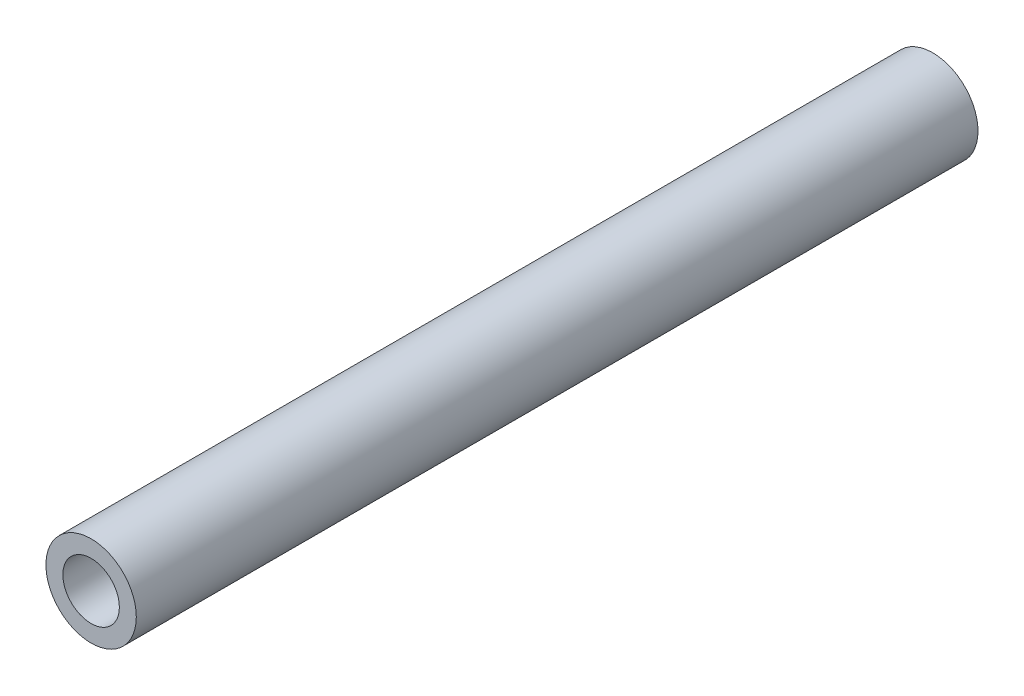
ISO-10303-21;
HEADER;
FILE_DESCRIPTION(('STEP AP214'),'2;1');
FILE_NAME('part.step','',(''),(''),'','','');
FILE_SCHEMA(('AUTOMOTIVE_DESIGN { 1 0 10303 214 1 1 1 1 }'));
ENDSEC;
DATA;
#1=APPLICATION_CONTEXT('core data for automotive mechanical design processes');
#2=APPLICATION_PROTOCOL_DEFINITION('international standard','automotive_design',2000,#1);
#3=PRODUCT_CONTEXT('',#1,'mechanical');
#4=PRODUCT('Part','Part','',(#3));
#5=PRODUCT_RELATED_PRODUCT_CATEGORY('part','',(#4));
#6=PRODUCT_DEFINITION_FORMATION('','',#4);
#7=PRODUCT_DEFINITION_CONTEXT('part definition',#1,'design');
#8=PRODUCT_DEFINITION('design','',#6,#7);
#9=PRODUCT_DEFINITION_SHAPE('','',#8);
#10=(LENGTH_UNIT() NAMED_UNIT(*) SI_UNIT(.MILLI.,.METRE.));
#11=(NAMED_UNIT(*) PLANE_ANGLE_UNIT() SI_UNIT($,.RADIAN.));
#12=(NAMED_UNIT(*) SI_UNIT($,.STERADIAN.) SOLID_ANGLE_UNIT());
#13=UNCERTAINTY_MEASURE_WITH_UNIT(LENGTH_MEASURE(1.E-05),#10,'distance_accuracy_value','');
#14=(GEOMETRIC_REPRESENTATION_CONTEXT(3) GLOBAL_UNCERTAINTY_ASSIGNED_CONTEXT((#13)) GLOBAL_UNIT_ASSIGNED_CONTEXT((#10,
#11,#12)) REPRESENTATION_CONTEXT('',''));
#15=CARTESIAN_POINT('',(0.,0.,0.));
#16=DIRECTION('',(0.,0.,1.));
#17=DIRECTION('',(1.,0.,0.));
#18=AXIS2_PLACEMENT_3D('',#15,#16,#17);
#19=CARTESIAN_POINT('',(0.,0.,74.5));
#20=DIRECTION('',(0.,0.,-1.));
#21=DIRECTION('',(-1.,0.,0.));
#22=AXIS2_PLACEMENT_3D('',#19,#20,#21);
#23=CYLINDRICAL_SURFACE('',#22,4.);
#24=CARTESIAN_POINT('',(0.,0.,74.5));
#25=DIRECTION('',(0.,0.,1.));
#26=DIRECTION('',(1.,0.,0.));
#27=AXIS2_PLACEMENT_3D('',#24,#25,#26);
#28=CIRCLE('',#27,4.);
#29=CARTESIAN_POINT('',(4.,0.,74.5));
#30=VERTEX_POINT('',#29);
#31=EDGE_CURVE('E10',#30,#30,#28,.T.);
#32=ORIENTED_EDGE('',*,*,#31,.F.);
#33=EDGE_LOOP('',(#32));
#34=FACE_BOUND('',#33,.T.);
#35=CARTESIAN_POINT('',(0.,0.,0.));
#36=DIRECTION('',(0.,0.,1.));
#37=DIRECTION('',(1.,0.,0.));
#38=AXIS2_PLACEMENT_3D('',#35,#36,#37);
#39=CIRCLE('',#38,4.);
#40=CARTESIAN_POINT('',(4.,0.,0.));
#41=VERTEX_POINT('',#40);
#42=EDGE_CURVE('E34',#41,#41,#39,.T.);
#43=ORIENTED_EDGE('',*,*,#42,.T.);
#44=EDGE_LOOP('',(#43));
#45=FACE_BOUND('',#44,.T.);
#46=ADVANCED_FACE('F31',(#34,#45),#23,.T.);
#47=CARTESIAN_POINT('',(0.,0.,74.5));
#48=DIRECTION('',(0.,0.,1.));
#49=DIRECTION('',(1.,0.,0.));
#50=AXIS2_PLACEMENT_3D('',#47,#48,#49);
#51=PLANE('',#50);
#52=CARTESIAN_POINT('',(0.,0.,74.5));
#53=DIRECTION('',(0.,0.,1.));
#54=DIRECTION('',(1.,0.,0.));
#55=AXIS2_PLACEMENT_3D('',#52,#53,#54);
#56=CIRCLE('',#55,2.5);
#57=CARTESIAN_POINT('',(2.5,0.,74.5));
#58=VERTEX_POINT('',#57);
#59=EDGE_CURVE('E43',#58,#58,#56,.T.);
#60=ORIENTED_EDGE('',*,*,#59,.F.);
#61=EDGE_LOOP('',(#60));
#62=FACE_BOUND('',#61,.T.);
#63=ORIENTED_EDGE('',*,*,#31,.T.);
#64=EDGE_LOOP('',(#63));
#65=FACE_BOUND('',#64,.T.);
#66=ADVANCED_FACE('F58',(#62,#65),#51,.T.);
#67=CARTESIAN_POINT('',(0.,0.,0.));
#68=DIRECTION('',(0.,0.,1.));
#69=DIRECTION('',(1.,0.,0.));
#70=AXIS2_PLACEMENT_3D('',#67,#68,#69);
#71=PLANE('',#70);
#72=ORIENTED_EDGE('',*,*,#42,.F.);
#73=EDGE_LOOP('',(#72));
#74=FACE_BOUND('',#73,.T.);
#75=ADVANCED_FACE('F54',(#74),#71,.F.);
#76=CARTESIAN_POINT('',(0.,0.,58.5));
#77=DIRECTION('',(0.,0.,1.));
#78=DIRECTION('',(1.,0.,0.));
#79=AXIS2_PLACEMENT_3D('',#76,#77,#78);
#80=CYLINDRICAL_SURFACE('',#79,2.5);
#81=CARTESIAN_POINT('',(0.,0.,58.5));
#82=DIRECTION('',(0.,0.,1.));
#83=DIRECTION('',(1.,0.,0.));
#84=AXIS2_PLACEMENT_3D('',#81,#82,#83);
#85=CIRCLE('',#84,2.5);
#86=CARTESIAN_POINT('',(2.5,0.,58.5));
#87=VERTEX_POINT('',#86);
#88=EDGE_CURVE('E41',#87,#87,#85,.T.);
#89=ORIENTED_EDGE('',*,*,#88,.F.);
#90=EDGE_LOOP('',(#89));
#91=FACE_BOUND('',#90,.T.);
#92=ORIENTED_EDGE('',*,*,#59,.T.);
#93=EDGE_LOOP('',(#92));
#94=FACE_BOUND('',#93,.T.);
#95=ADVANCED_FACE('F51',(#91,#94),#80,.F.);
#96=CARTESIAN_POINT('',(0.,0.,58.5));
#97=DIRECTION('',(0.,0.,1.));
#98=DIRECTION('',(1.,0.,0.));
#99=AXIS2_PLACEMENT_3D('',#96,#97,#98);
#100=PLANE('',#99);
#101=ORIENTED_EDGE('',*,*,#88,.T.);
#102=EDGE_LOOP('',(#101));
#103=FACE_BOUND('',#102,.T.);
#104=ADVANCED_FACE('F49',(#103),#100,.T.);
#105=CLOSED_SHELL('',(#46,#66,#75,#95,#104));
#106=MANIFOLD_SOLID_BREP('B2',#105);
#107=ADVANCED_BREP_SHAPE_REPRESENTATION('',(#18,#106),#14);
#108=SHAPE_DEFINITION_REPRESENTATION(#9,#107);
ENDSEC;
END-ISO-10303-21;
